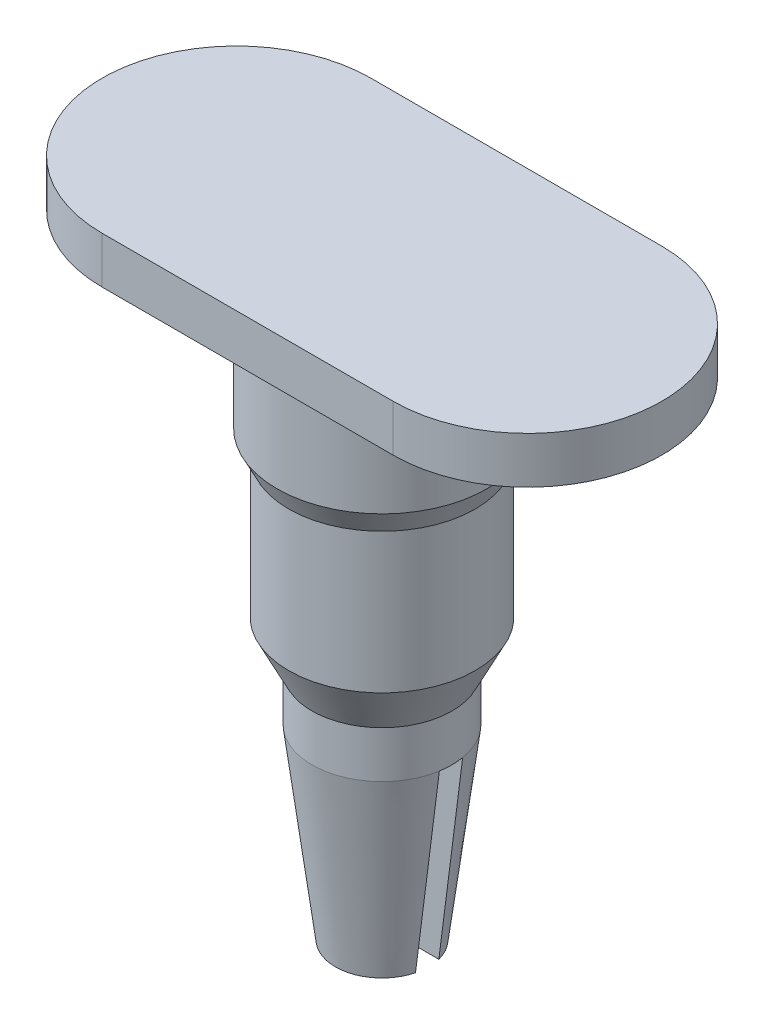
ISO-10303-21;
HEADER;
FILE_DESCRIPTION(('STEP AP214'),'2;1');
FILE_NAME('part.step','',(''),(''),'','','');
FILE_SCHEMA(('AUTOMOTIVE_DESIGN { 1 0 10303 214 1 1 1 1 }'));
ENDSEC;
DATA;
#1=APPLICATION_CONTEXT('core data for automotive mechanical design processes');
#2=APPLICATION_PROTOCOL_DEFINITION('international standard','automotive_design',2000,#1);
#3=PRODUCT_CONTEXT('',#1,'mechanical');
#4=PRODUCT('Part','Part','',(#3));
#5=PRODUCT_RELATED_PRODUCT_CATEGORY('part','',(#4));
#6=PRODUCT_DEFINITION_FORMATION('','',#4);
#7=PRODUCT_DEFINITION_CONTEXT('part definition',#1,'design');
#8=PRODUCT_DEFINITION('design','',#6,#7);
#9=PRODUCT_DEFINITION_SHAPE('','',#8);
#10=(LENGTH_UNIT() NAMED_UNIT(*) SI_UNIT(.MILLI.,.METRE.));
#11=(NAMED_UNIT(*) PLANE_ANGLE_UNIT() SI_UNIT($,.RADIAN.));
#12=(NAMED_UNIT(*) SI_UNIT($,.STERADIAN.) SOLID_ANGLE_UNIT());
#13=UNCERTAINTY_MEASURE_WITH_UNIT(LENGTH_MEASURE(1.E-05),#10,'distance_accuracy_value','');
#14=(GEOMETRIC_REPRESENTATION_CONTEXT(3) GLOBAL_UNCERTAINTY_ASSIGNED_CONTEXT((#13)) GLOBAL_UNIT_ASSIGNED_CONTEXT((#10,
#11,#12)) REPRESENTATION_CONTEXT('',''));
#15=CARTESIAN_POINT('',(0.,0.,0.));
#16=DIRECTION('',(0.,0.,1.));
#17=DIRECTION('',(1.,0.,0.));
#18=AXIS2_PLACEMENT_3D('',#15,#16,#17);
#19=CARTESIAN_POINT('',(0.,-1.2,0.));
#20=DIRECTION('',(0.,-1.,0.));
#21=DIRECTION('',(0.,0.,-1.));
#22=AXIS2_PLACEMENT_3D('',#19,#20,#21);
#23=PLANE('',#22);
#24=DIRECTION('',(-1.,0.,0.));
#25=VECTOR('',#24,1.);
#26=CARTESIAN_POINT('',(0.,-1.2,0.025));
#27=LINE('',#26,#25);
#28=CARTESIAN_POINT('',(0.0968245836589107,-1.20000000000149,0.025));
#29=VERTEX_POINT('',#28);
#30=CARTESIAN_POINT('',(-0.0968245836551857,-1.2,0.025));
#31=VERTEX_POINT('',#30);
#32=EDGE_CURVE('E171',#29,#31,#27,.T.);
#33=ORIENTED_EDGE('',*,*,#32,.F.);
#34=CARTESIAN_POINT('',(0.,-1.2,0.));
#35=DIRECTION('',(0.,-1.,0.));
#36=DIRECTION('',(0.,0.,-1.));
#37=AXIS2_PLACEMENT_3D('',#34,#35,#36);
#38=CIRCLE('',#37,0.1);
#39=EDGE_CURVE('E142',#29,#31,#38,.T.);
#40=ORIENTED_EDGE('',*,*,#39,.T.);
#41=EDGE_LOOP('',(#33,#40));
#42=FACE_BOUND('',#41,.T.);
#43=ADVANCED_FACE('F34',(#42),#23,.T.);
#44=CARTESIAN_POINT('',(0.,-1.2,0.));
#45=DIRECTION('',(0.,1.,0.));
#46=DIRECTION('',(0.,0.,1.));
#47=AXIS2_PLACEMENT_3D('',#44,#45,#46);
#48=CONICAL_SURFACE('',#47,0.1,0.124354994546758);
#49=CARTESIAN_POINT('',(-0.0317032460776887,-1.67700443972217,0.025));
#50=CARTESIAN_POINT('',(-0.0335829837651525,-1.66517906933861,0.025));
#51=CARTESIAN_POINT('',(-0.0354065070197008,-1.65334502745118,0.025));
#52=CARTESIAN_POINT('',(-0.0389736756587839,-1.62966519515292,0.025));
#53=CARTESIAN_POINT('',(-0.040717323165755,-1.61781940506282,0.025));
#54=CARTESIAN_POINT('',(-0.0493175060759662,-1.55857334906298,0.025));
#55=CARTESIAN_POINT('',(-0.0558198112307603,-1.5111222072682,0.025));
#56=CARTESIAN_POINT('',(-0.068595251451964,-1.41618822667342,0.025));
#57=CARTESIAN_POINT('',(-0.0748683770835648,-1.36870538665023,0.025));
#58=CARTESIAN_POINT('',(-0.0875253231380363,-1.27196073057179,0.025));
#59=CARTESIAN_POINT('',(-0.0939046069557889,-1.22269831456726,0.025));
#60=CARTESIAN_POINT('',(-0.108079935026955,-1.11265394680097,0.025));
#61=CARTESIAN_POINT('',(-0.115858746762481,-1.05186979546357,0.025));
#62=CARTESIAN_POINT('',(-0.139118563366662,-0.869506307910763,0.025));
#63=CARTESIAN_POINT('',(-0.154522789615704,-0.747917176119612,0.025));
#64=CARTESIAN_POINT('',(-0.185237023035073,-0.504729418553655,0.025));
#65=CARTESIAN_POINT('',(-0.200547032045386,-0.383130793011521,0.025));
#66=CARTESIAN_POINT('',(-0.215865492230613,-0.26153335174303,0.025));
#67=B_SPLINE_CURVE_WITH_KNOTS('',3,(#49,#50,#51,#52,#53,#54,#55,#56,#57,#58,#59,#60,#61,#62,#63,
#64,#65,#66),.UNSPECIFIED.,.F.,.F.,(4,2,2,2,2,2,2,2,4),(0.,0.035921013688271,0.0718410723389458,
0.215521752663841,0.359208341351159,0.508229341512162,0.692068972056252,1.0597519779313,
1.42742778032687),.UNSPECIFIED.);
#68=CARTESIAN_POINT('',(-0.147901994577608,-0.799999999999063,0.025));
#69=VERTEX_POINT('',#68);
#70=EDGE_CURVE('E11',#31,#69,#67,.T.);
#71=ORIENTED_EDGE('',*,*,#70,.F.);
#72=ORIENTED_EDGE('',*,*,#39,.F.);
#73=CARTESIAN_POINT('',(0.215865492230613,-0.26153335174303,0.025));
#74=CARTESIAN_POINT('',(0.207819214743317,-0.325471915541506,0.025));
#75=CARTESIAN_POINT('',(0.199768082490048,-0.389409870181639,0.025));
#76=CARTESIAN_POINT('',(0.183648792847683,-0.51728380568221,0.025));
#77=CARTESIAN_POINT('',(0.175580635413383,-0.58121978653695,0.025));
#78=CARTESIAN_POINT('',(0.1563713845448,-0.733210657728297,0.025));
#79=CARTESIAN_POINT('',(0.1452193942396,-0.821264171628763,0.025));
#80=CARTESIAN_POINT('',(0.122829119702691,-0.997360032451911,0.025));
#81=CARTESIAN_POINT('',(0.111590835682982,-1.08540237940149,0.025));
#82=CARTESIAN_POINT('',(0.0924214676273853,-1.23420938511122,0.025));
#83=CARTESIAN_POINT('',(0.0845435941476383,-1.29498086912998,0.025));
#84=CARTESIAN_POINT('',(0.0730297508768629,-1.38253890559944,0.025));
#85=CARTESIAN_POINT('',(0.0694836881897017,-1.40933722503783,0.025));
#86=CARTESIAN_POINT('',(0.0623184414467283,-1.46292376838855,0.025));
#87=CARTESIAN_POINT('',(0.0586992581062708,-1.48971199239703,0.025));
#88=CARTESIAN_POINT('',(0.0513514697983395,-1.54327486814926,0.025));
#89=CARTESIAN_POINT('',(0.0476228605483403,-1.57004951932,0.025));
#90=CARTESIAN_POINT('',(0.0399006610155855,-1.62356131858246,0.025));
#91=CARTESIAN_POINT('',(0.0359070610528927,-1.6502984652677,0.025));
#92=CARTESIAN_POINT('',(0.0317032460776887,-1.67700443972217,0.025));
#93=B_SPLINE_CURVE_WITH_KNOTS('',3,(#73,#74,#75,#76,#77,#78,#79,#80,#81,#82,#83,#84,#85,#86,#87,
#88,#89,#90,#91,#92),.UNSPECIFIED.,.F.,.F.,(4,2,2,2,2,2,2,2,2,4),(0.,0.193328589838363,
0.386657693622528,0.652928392957556,0.919198438348345,1.10303814194397,1.18413378444464,
1.26522863395345,1.34632666145826,1.42742765305355),.UNSPECIFIED.);
#94=CARTESIAN_POINT('',(0.147901994577608,-0.799999999999063,0.025));
#95=VERTEX_POINT('',#94);
#96=EDGE_CURVE('E47',#95,#29,#93,.T.);
#97=ORIENTED_EDGE('',*,*,#96,.F.);
#98=CARTESIAN_POINT('',(0.,-0.799999999999991,0.));
#99=DIRECTION('',(0.,-1.,0.));
#100=DIRECTION('',(0.,0.,-1.));
#101=AXIS2_PLACEMENT_3D('',#98,#99,#100);
#102=CIRCLE('',#101,0.15);
#103=EDGE_CURVE('E126',#69,#95,#102,.F.);
#104=ORIENTED_EDGE('',*,*,#103,.F.);
#105=EDGE_LOOP('',(#71,#72,#97,#104));
#106=FACE_BOUND('',#105,.T.);
#107=ADVANCED_FACE('F178',(#106),#48,.T.);
#108=CARTESIAN_POINT('',(-0.312,0.1,0.));
#109=DIRECTION('',(0.,-1.,0.));
#110=DIRECTION('',(0.,0.,-1.));
#111=AXIS2_PLACEMENT_3D('',#108,#109,#110);
#112=CYLINDRICAL_SURFACE('',#111,0.288);
#113=CARTESIAN_POINT('',(-0.312,0.,0.));
#114=DIRECTION('',(0.,1.,0.));
#115=DIRECTION('',(0.,0.,1.));
#116=AXIS2_PLACEMENT_3D('',#113,#114,#115);
#117=CIRCLE('',#116,0.288);
#118=CARTESIAN_POINT('',(-0.312,0.,-0.288));
#119=VERTEX_POINT('',#118);
#120=CARTESIAN_POINT('',(-0.312,0.,0.288));
#121=VERTEX_POINT('',#120);
#122=EDGE_CURVE('E241',#119,#121,#117,.T.);
#123=ORIENTED_EDGE('',*,*,#122,.T.);
#124=DIRECTION('',(0.,-1.,0.));
#125=VECTOR('',#124,1.);
#126=CARTESIAN_POINT('',(-0.312,0.1,0.288));
#127=LINE('',#126,#125);
#128=CARTESIAN_POINT('',(-0.312,0.1,0.288));
#129=VERTEX_POINT('',#128);
#130=EDGE_CURVE('E262',#129,#121,#127,.T.);
#131=ORIENTED_EDGE('',*,*,#130,.F.);
#132=CARTESIAN_POINT('',(-0.312,0.1,0.));
#133=DIRECTION('',(0.,1.,0.));
#134=DIRECTION('',(0.,0.,1.));
#135=AXIS2_PLACEMENT_3D('',#132,#133,#134);
#136=CIRCLE('',#135,0.288);
#137=CARTESIAN_POINT('',(-0.312,0.1,-0.288));
#138=VERTEX_POINT('',#137);
#139=EDGE_CURVE('E242',#138,#129,#136,.T.);
#140=ORIENTED_EDGE('',*,*,#139,.F.);
#141=DIRECTION('',(0.,-1.,0.));
#142=VECTOR('',#141,1.);
#143=CARTESIAN_POINT('',(-0.312,0.1,-0.288));
#144=LINE('',#143,#142);
#145=EDGE_CURVE('E248',#138,#119,#144,.T.);
#146=ORIENTED_EDGE('',*,*,#145,.T.);
#147=EDGE_LOOP('',(#123,#131,#140,#146));
#148=FACE_BOUND('',#147,.T.);
#149=ADVANCED_FACE('F180',(#148),#112,.T.);
#150=CARTESIAN_POINT('',(0.312,0.1,0.288));
#151=DIRECTION('',(0.,0.,-1.));
#152=DIRECTION('',(-1.,0.,0.));
#153=AXIS2_PLACEMENT_3D('',#150,#151,#152);
#154=PLANE('',#153);
#155=DIRECTION('',(1.,0.,0.));
#156=VECTOR('',#155,1.);
#157=CARTESIAN_POINT('',(0.312,0.,0.288));
#158=LINE('',#157,#156);
#159=CARTESIAN_POINT('',(0.312,0.,0.288));
#160=VERTEX_POINT('',#159);
#161=EDGE_CURVE('E251',#121,#160,#158,.T.);
#162=ORIENTED_EDGE('',*,*,#161,.T.);
#163=DIRECTION('',(0.,-1.,0.));
#164=VECTOR('',#163,1.);
#165=CARTESIAN_POINT('',(0.312,0.1,0.288));
#166=LINE('',#165,#164);
#167=CARTESIAN_POINT('',(0.312,0.1,0.288));
#168=VERTEX_POINT('',#167);
#169=EDGE_CURVE('E259',#168,#160,#166,.T.);
#170=ORIENTED_EDGE('',*,*,#169,.F.);
#171=DIRECTION('',(1.,0.,0.));
#172=VECTOR('',#171,1.);
#173=CARTESIAN_POINT('',(0.312,0.1,0.288));
#174=LINE('',#173,#172);
#175=EDGE_CURVE('E92',#129,#168,#174,.T.);
#176=ORIENTED_EDGE('',*,*,#175,.F.);
#177=ORIENTED_EDGE('',*,*,#130,.T.);
#178=EDGE_LOOP('',(#162,#170,#176,#177));
#179=FACE_BOUND('',#178,.T.);
#180=ADVANCED_FACE('F185',(#179),#154,.F.);
#181=CARTESIAN_POINT('',(0.312,0.1,0.));
#182=DIRECTION('',(0.,-1.,0.));
#183=DIRECTION('',(0.,0.,-1.));
#184=AXIS2_PLACEMENT_3D('',#181,#182,#183);
#185=CYLINDRICAL_SURFACE('',#184,0.288);
#186=CARTESIAN_POINT('',(0.312,0.,0.));
#187=DIRECTION('',(0.,1.,0.));
#188=DIRECTION('',(0.,0.,1.));
#189=AXIS2_PLACEMENT_3D('',#186,#187,#188);
#190=CIRCLE('',#189,0.288);
#191=CARTESIAN_POINT('',(0.312,0.,-0.288));
#192=VERTEX_POINT('',#191);
#193=EDGE_CURVE('E253',#160,#192,#190,.T.);
#194=ORIENTED_EDGE('',*,*,#193,.T.);
#195=DIRECTION('',(0.,-1.,0.));
#196=VECTOR('',#195,1.);
#197=CARTESIAN_POINT('',(0.312,0.1,-0.288));
#198=LINE('',#197,#196);
#199=CARTESIAN_POINT('',(0.312,0.1,-0.288));
#200=VERTEX_POINT('',#199);
#201=EDGE_CURVE('E257',#200,#192,#198,.T.);
#202=ORIENTED_EDGE('',*,*,#201,.F.);
#203=CARTESIAN_POINT('',(0.312,0.1,0.));
#204=DIRECTION('',(0.,1.,0.));
#205=DIRECTION('',(0.,0.,1.));
#206=AXIS2_PLACEMENT_3D('',#203,#204,#205);
#207=CIRCLE('',#206,0.288);
#208=EDGE_CURVE('E245',#168,#200,#207,.T.);
#209=ORIENTED_EDGE('',*,*,#208,.F.);
#210=ORIENTED_EDGE('',*,*,#169,.T.);
#211=EDGE_LOOP('',(#194,#202,#209,#210));
#212=FACE_BOUND('',#211,.T.);
#213=ADVANCED_FACE('F205',(#212),#185,.T.);
#214=CARTESIAN_POINT('',(-0.312,0.1,-0.288));
#215=DIRECTION('',(0.,0.,1.));
#216=DIRECTION('',(1.,0.,0.));
#217=AXIS2_PLACEMENT_3D('',#214,#215,#216);
#218=PLANE('',#217);
#219=DIRECTION('',(-1.,0.,0.));
#220=VECTOR('',#219,1.);
#221=CARTESIAN_POINT('',(-0.312,0.,-0.288));
#222=LINE('',#221,#220);
#223=EDGE_CURVE('E84',#192,#119,#222,.T.);
#224=ORIENTED_EDGE('',*,*,#223,.T.);
#225=ORIENTED_EDGE('',*,*,#145,.F.);
#226=DIRECTION('',(-1.,0.,0.));
#227=VECTOR('',#226,1.);
#228=CARTESIAN_POINT('',(-0.312,0.1,-0.288));
#229=LINE('',#228,#227);
#230=EDGE_CURVE('E63',#200,#138,#229,.T.);
#231=ORIENTED_EDGE('',*,*,#230,.F.);
#232=ORIENTED_EDGE('',*,*,#201,.T.);
#233=EDGE_LOOP('',(#224,#225,#231,#232));
#234=FACE_BOUND('',#233,.T.);
#235=ADVANCED_FACE('F208',(#234),#218,.F.);
#236=CARTESIAN_POINT('',(-0.312,0.1,0.));
#237=DIRECTION('',(0.,1.,0.));
#238=DIRECTION('',(0.,0.,1.));
#239=AXIS2_PLACEMENT_3D('',#236,#237,#238);
#240=PLANE('',#239);
#241=ORIENTED_EDGE('',*,*,#139,.T.);
#242=ORIENTED_EDGE('',*,*,#175,.T.);
#243=ORIENTED_EDGE('',*,*,#208,.T.);
#244=ORIENTED_EDGE('',*,*,#230,.T.);
#245=EDGE_LOOP('',(#241,#242,#243,#244));
#246=FACE_BOUND('',#245,.T.);
#247=ADVANCED_FACE('F212',(#246),#240,.T.);
#248=CARTESIAN_POINT('',(-0.312,0.,0.));
#249=DIRECTION('',(0.,1.,0.));
#250=DIRECTION('',(0.,0.,1.));
#251=AXIS2_PLACEMENT_3D('',#248,#249,#250);
#252=PLANE('',#251);
#253=CARTESIAN_POINT('',(0.,0.,0.));
#254=DIRECTION('',(0.,1.,0.));
#255=DIRECTION('',(0.,0.,1.));
#256=AXIS2_PLACEMENT_3D('',#253,#254,#255);
#257=CIRCLE('',#256,0.225);
#258=CARTESIAN_POINT('',(0.,0.,0.225));
#259=VERTEX_POINT('',#258);
#260=EDGE_CURVE('E238',#259,#259,#257,.T.);
#261=ORIENTED_EDGE('',*,*,#260,.T.);
#262=EDGE_LOOP('',(#261));
#263=FACE_BOUND('',#262,.T.);
#264=ORIENTED_EDGE('',*,*,#122,.F.);
#265=ORIENTED_EDGE('',*,*,#223,.F.);
#266=ORIENTED_EDGE('',*,*,#193,.F.);
#267=ORIENTED_EDGE('',*,*,#161,.F.);
#268=EDGE_LOOP('',(#264,#265,#266,#267));
#269=FACE_BOUND('',#268,.T.);
#270=ADVANCED_FACE('F213',(#263,#269),#252,.F.);
#271=CARTESIAN_POINT('',(0.,-0.3,0.));
#272=DIRECTION('',(0.,1.,0.));
#273=DIRECTION('',(0.,0.,1.));
#274=AXIS2_PLACEMENT_3D('',#271,#272,#273);
#275=CYLINDRICAL_SURFACE('',#274,0.225);
#276=CARTESIAN_POINT('',(0.,-0.25,0.));
#277=DIRECTION('',(0.,1.,0.));
#278=DIRECTION('',(0.,0.,1.));
#279=AXIS2_PLACEMENT_3D('',#276,#277,#278);
#280=CIRCLE('',#279,0.225);
#281=CARTESIAN_POINT('',(0.,-0.25,0.225));
#282=VERTEX_POINT('',#281);
#283=EDGE_CURVE('E267',#282,#282,#280,.T.);
#284=ORIENTED_EDGE('',*,*,#283,.T.);
#285=EDGE_LOOP('',(#284));
#286=FACE_BOUND('',#285,.T.);
#287=ORIENTED_EDGE('',*,*,#260,.F.);
#288=EDGE_LOOP('',(#287));
#289=FACE_BOUND('',#288,.T.);
#290=ADVANCED_FACE('F216',(#286,#289),#275,.T.);
#291=CARTESIAN_POINT('',(0.,-0.7,0.));
#292=DIRECTION('',(0.,1.,0.));
#293=DIRECTION('',(0.,0.,1.));
#294=AXIS2_PLACEMENT_3D('',#291,#292,#293);
#295=CYLINDRICAL_SURFACE('',#294,0.2);
#296=CARTESIAN_POINT('',(0.,-0.599999999999998,0.));
#297=DIRECTION('',(0.,-1.,0.));
#298=DIRECTION('',(0.,0.,-1.));
#299=AXIS2_PLACEMENT_3D('',#296,#297,#298);
#300=CIRCLE('',#299,0.2);
#301=CARTESIAN_POINT('',(0.,-0.599999999999998,-0.2));
#302=VERTEX_POINT('',#301);
#303=EDGE_CURVE('E269',#302,#302,#300,.F.);
#304=ORIENTED_EDGE('',*,*,#303,.T.);
#305=EDGE_LOOP('',(#304));
#306=FACE_BOUND('',#305,.T.);
#307=CARTESIAN_POINT('',(0.,-0.3,0.));
#308=DIRECTION('',(0.,1.,0.));
#309=DIRECTION('',(0.,0.,1.));
#310=AXIS2_PLACEMENT_3D('',#307,#308,#309);
#311=CIRCLE('',#310,0.2);
#312=CARTESIAN_POINT('',(0.,-0.3,0.2));
#313=VERTEX_POINT('',#312);
#314=EDGE_CURVE('E264',#313,#313,#311,.F.);
#315=ORIENTED_EDGE('',*,*,#314,.T.);
#316=EDGE_LOOP('',(#315));
#317=FACE_BOUND('',#316,.T.);
#318=ADVANCED_FACE('F222',(#306,#317),#295,.T.);
#319=CARTESIAN_POINT('',(0.,-0.8,0.));
#320=DIRECTION('',(0.,1.,0.));
#321=DIRECTION('',(0.,0.,1.));
#322=AXIS2_PLACEMENT_3D('',#319,#320,#321);
#323=CYLINDRICAL_SURFACE('',#322,0.15);
#324=CARTESIAN_POINT('',(-0.147901994577608,-0.799999999999063,-0.025));
#325=VERTEX_POINT('',#324);
#326=EDGE_CURVE('E114',#325,#69,#102,.F.);
#327=ORIENTED_EDGE('',*,*,#326,.T.);
#328=ORIENTED_EDGE('',*,*,#103,.T.);
#329=CARTESIAN_POINT('',(0.147901994577608,-0.799999999999063,-0.025));
#330=VERTEX_POINT('',#329);
#331=EDGE_CURVE('E141',#95,#330,#102,.F.);
#332=ORIENTED_EDGE('',*,*,#331,.T.);
#333=EDGE_CURVE('E128',#330,#325,#102,.F.);
#334=ORIENTED_EDGE('',*,*,#333,.T.);
#335=EDGE_LOOP('',(#327,#328,#332,#334));
#336=FACE_BOUND('',#335,.T.);
#337=CARTESIAN_POINT('',(0.,-0.7,0.));
#338=DIRECTION('',(0.,-1.,0.));
#339=DIRECTION('',(0.,0.,-1.));
#340=AXIS2_PLACEMENT_3D('',#337,#338,#339);
#341=CIRCLE('',#340,0.15);
#342=CARTESIAN_POINT('',(0.,-0.7,-0.15));
#343=VERTEX_POINT('',#342);
#344=EDGE_CURVE('E176',#343,#343,#341,.T.);
#345=ORIENTED_EDGE('',*,*,#344,.T.);
#346=EDGE_LOOP('',(#345));
#347=FACE_BOUND('',#346,.T.);
#348=ADVANCED_FACE('F139',(#336,#347),#323,.T.);
#349=DIRECTION('',(1.,0.,0.));
#350=VECTOR('',#349,1.);
#351=CARTESIAN_POINT('',(0.,-1.2,-0.025));
#352=LINE('',#351,#350);
#353=CARTESIAN_POINT('',(-0.0968245836551857,-1.2,-0.025));
#354=VERTEX_POINT('',#353);
#355=CARTESIAN_POINT('',(0.0968245836551857,-1.2,-0.025));
#356=VERTEX_POINT('',#355);
#357=EDGE_CURVE('E54',#354,#356,#352,.T.);
#358=ORIENTED_EDGE('',*,*,#357,.F.);
#359=EDGE_CURVE('E137',#354,#356,#38,.T.);
#360=ORIENTED_EDGE('',*,*,#359,.T.);
#361=EDGE_LOOP('',(#358,#360));
#362=FACE_BOUND('',#361,.T.);
#363=ADVANCED_FACE('F163',(#362),#23,.T.);
#364=CARTESIAN_POINT('',(0.,-0.25,0.));
#365=DIRECTION('',(0.,1.,0.));
#366=DIRECTION('',(0.,0.,1.));
#367=AXIS2_PLACEMENT_3D('',#364,#365,#366);
#368=CONICAL_SURFACE('',#367,0.225,0.463647609000804);
#369=ORIENTED_EDGE('',*,*,#314,.F.);
#370=EDGE_LOOP('',(#369));
#371=FACE_BOUND('',#370,.T.);
#372=ORIENTED_EDGE('',*,*,#283,.F.);
#373=EDGE_LOOP('',(#372));
#374=FACE_BOUND('',#373,.T.);
#375=ADVANCED_FACE('F193',(#371,#374),#368,.T.);
#376=CARTESIAN_POINT('',(0.,-0.7,0.));
#377=DIRECTION('',(0.,1.,0.));
#378=DIRECTION('',(0.,0.,1.));
#379=AXIS2_PLACEMENT_3D('',#376,#377,#378);
#380=CONICAL_SURFACE('',#379,0.149999999999999,0.463647609000805);
#381=ORIENTED_EDGE('',*,*,#303,.F.);
#382=EDGE_LOOP('',(#381));
#383=FACE_BOUND('',#382,.T.);
#384=ORIENTED_EDGE('',*,*,#344,.F.);
#385=EDGE_LOOP('',(#384));
#386=FACE_BOUND('',#385,.T.);
#387=ADVANCED_FACE('F189',(#383,#386),#380,.T.);
#388=CARTESIAN_POINT('',(-0.215865492230613,-0.26153335174303,-0.025));
#389=CARTESIAN_POINT('',(-0.207819214743317,-0.325471915541506,-0.025));
#390=CARTESIAN_POINT('',(-0.199768082490048,-0.389409870181639,-0.025));
#391=CARTESIAN_POINT('',(-0.183648792847683,-0.51728380568221,-0.025));
#392=CARTESIAN_POINT('',(-0.175580635413383,-0.58121978653695,-0.025));
#393=CARTESIAN_POINT('',(-0.1563713845448,-0.733210657728297,-0.025));
#394=CARTESIAN_POINT('',(-0.1452193942396,-0.821264171628763,-0.025));
#395=CARTESIAN_POINT('',(-0.122829119702691,-0.997360032451911,-0.025));
#396=CARTESIAN_POINT('',(-0.111590835682982,-1.08540237940149,-0.025));
#397=CARTESIAN_POINT('',(-0.0924214676273853,-1.23420938511122,-0.025));
#398=CARTESIAN_POINT('',(-0.0845435941476383,-1.29498086912998,-0.025));
#399=CARTESIAN_POINT('',(-0.0730297508768629,-1.38253890559944,-0.025));
#400=CARTESIAN_POINT('',(-0.0694836881897017,-1.40933722503783,-0.025));
#401=CARTESIAN_POINT('',(-0.0623184414467283,-1.46292376838855,-0.025));
#402=CARTESIAN_POINT('',(-0.0586992581062708,-1.48971199239703,-0.025));
#403=CARTESIAN_POINT('',(-0.0513514697983395,-1.54327486814926,-0.025));
#404=CARTESIAN_POINT('',(-0.0476228605483403,-1.57004951932,-0.025));
#405=CARTESIAN_POINT('',(-0.0399006610155855,-1.62356131858246,-0.025));
#406=CARTESIAN_POINT('',(-0.0359070610528927,-1.6502984652677,-0.025));
#407=CARTESIAN_POINT('',(-0.0317032460776887,-1.67700443972217,-0.025));
#408=B_SPLINE_CURVE_WITH_KNOTS('',3,(#388,#389,#390,#391,#392,#393,#394,#395,#396,#397,#398,
#399,#400,#401,#402,#403,#404,#405,#406,#407),.UNSPECIFIED.,.F.,.F.,(4,2,2,2,2,2,2,2,2,4),(0.,
0.193328589838363,0.386657693622528,0.652928392957556,0.919198438348345,1.10303814194397,
1.18413378444464,1.26522863395345,1.34632666145826,1.42742765305355),.UNSPECIFIED.);
#409=EDGE_CURVE('E131',#325,#354,#408,.T.);
#410=ORIENTED_EDGE('',*,*,#409,.F.);
#411=ORIENTED_EDGE('',*,*,#333,.F.);
#412=CARTESIAN_POINT('',(0.0317032460776887,-1.67700443972217,-0.025));
#413=CARTESIAN_POINT('',(0.0335829837651525,-1.66517906933861,-0.025));
#414=CARTESIAN_POINT('',(0.0354065070197008,-1.65334502745118,-0.025));
#415=CARTESIAN_POINT('',(0.0389736756587839,-1.62966519515292,-0.025));
#416=CARTESIAN_POINT('',(0.040717323165755,-1.61781940506282,-0.025));
#417=CARTESIAN_POINT('',(0.0493175060759662,-1.55857334906298,-0.025));
#418=CARTESIAN_POINT('',(0.0558198112307603,-1.5111222072682,-0.025));
#419=CARTESIAN_POINT('',(0.068595251451964,-1.41618822667342,-0.025));
#420=CARTESIAN_POINT('',(0.0748683770835648,-1.36870538665023,-0.025));
#421=CARTESIAN_POINT('',(0.0875253231380363,-1.27196073057179,-0.025));
#422=CARTESIAN_POINT('',(0.0939046069557889,-1.22269831456726,-0.025));
#423=CARTESIAN_POINT('',(0.108079935026955,-1.11265394680097,-0.025));
#424=CARTESIAN_POINT('',(0.115858746762481,-1.05186979546357,-0.025));
#425=CARTESIAN_POINT('',(0.139118563366662,-0.869506307910763,-0.025));
#426=CARTESIAN_POINT('',(0.154522789615704,-0.747917176119612,-0.025));
#427=CARTESIAN_POINT('',(0.185237023035073,-0.504729418553655,-0.025));
#428=CARTESIAN_POINT('',(0.200547032045386,-0.383130793011521,-0.025));
#429=CARTESIAN_POINT('',(0.215865492230613,-0.26153335174303,-0.025));
#430=B_SPLINE_CURVE_WITH_KNOTS('',3,(#412,#413,#414,#415,#416,#417,#418,#419,#420,#421,#422,
#423,#424,#425,#426,#427,#428,#429),.UNSPECIFIED.,.F.,.F.,(4,2,2,2,2,2,2,2,4),(0.,
0.035921013688271,0.0718410723389458,0.215521752663841,0.359208341351159,0.508229341512162,
0.692068972056252,1.0597519779313,1.42742778032687),.UNSPECIFIED.);
#431=EDGE_CURVE('E125',#356,#330,#430,.T.);
#432=ORIENTED_EDGE('',*,*,#431,.F.);
#433=ORIENTED_EDGE('',*,*,#359,.F.);
#434=EDGE_LOOP('',(#410,#411,#432,#433));
#435=FACE_BOUND('',#434,.T.);
#436=ADVANCED_FACE('F36',(#435),#48,.T.);
#437=CARTESIAN_POINT('',(-0.6,-0.799999999999063,0.025));
#438=DIRECTION('',(0.,0.,1.));
#439=DIRECTION('',(1.,0.,0.));
#440=AXIS2_PLACEMENT_3D('',#437,#438,#439);
#441=PLANE('',#440);
#442=ORIENTED_EDGE('',*,*,#70,.T.);
#443=DIRECTION('',(1.,0.,0.));
#444=VECTOR('',#443,1.);
#445=CARTESIAN_POINT('',(-0.6,-0.799999999999063,0.025));
#446=LINE('',#445,#444);
#447=EDGE_CURVE('E120',#69,#95,#446,.T.);
#448=ORIENTED_EDGE('',*,*,#447,.T.);
#449=ORIENTED_EDGE('',*,*,#96,.T.);
#450=ORIENTED_EDGE('',*,*,#32,.T.);
#451=EDGE_LOOP('',(#442,#448,#449,#450));
#452=FACE_BOUND('',#451,.T.);
#453=ADVANCED_FACE('F157',(#452),#441,.F.);
#454=CARTESIAN_POINT('',(-0.6,-0.799999999999063,0.025));
#455=DIRECTION('',(0.,1.,0.));
#456=DIRECTION('',(0.,0.,1.));
#457=AXIS2_PLACEMENT_3D('',#454,#455,#456);
#458=PLANE('',#457);
#459=ORIENTED_EDGE('',*,*,#326,.F.);
#460=DIRECTION('',(1.,0.,0.));
#461=VECTOR('',#460,1.);
#462=CARTESIAN_POINT('',(-0.6,-0.799999999999063,-0.025));
#463=LINE('',#462,#461);
#464=EDGE_CURVE('E117',#325,#330,#463,.T.);
#465=ORIENTED_EDGE('',*,*,#464,.T.);
#466=ORIENTED_EDGE('',*,*,#331,.F.);
#467=ORIENTED_EDGE('',*,*,#447,.F.);
#468=EDGE_LOOP('',(#459,#465,#466,#467));
#469=FACE_BOUND('',#468,.T.);
#470=ADVANCED_FACE('F116',(#469),#458,.F.);
#471=CARTESIAN_POINT('',(-0.6,-0.799999999999063,-0.025));
#472=DIRECTION('',(0.,0.,-1.));
#473=DIRECTION('',(-1.,0.,0.));
#474=AXIS2_PLACEMENT_3D('',#471,#472,#473);
#475=PLANE('',#474);
#476=ORIENTED_EDGE('',*,*,#409,.T.);
#477=ORIENTED_EDGE('',*,*,#357,.T.);
#478=ORIENTED_EDGE('',*,*,#431,.T.);
#479=ORIENTED_EDGE('',*,*,#464,.F.);
#480=EDGE_LOOP('',(#476,#477,#478,#479));
#481=FACE_BOUND('',#480,.T.);
#482=ADVANCED_FACE('F130',(#481),#475,.F.);
#483=CLOSED_SHELL('',(#43,#107,#149,#180,#213,#235,#247,#270,#290,#318,#348,#363,#375,#387,#436,
#453,#470,#482));
#484=MANIFOLD_SOLID_BREP('B2',#483);
#485=ADVANCED_BREP_SHAPE_REPRESENTATION('',(#18,#484),#14);
#486=SHAPE_DEFINITION_REPRESENTATION(#9,#485);
ENDSEC;
END-ISO-10303-21;
